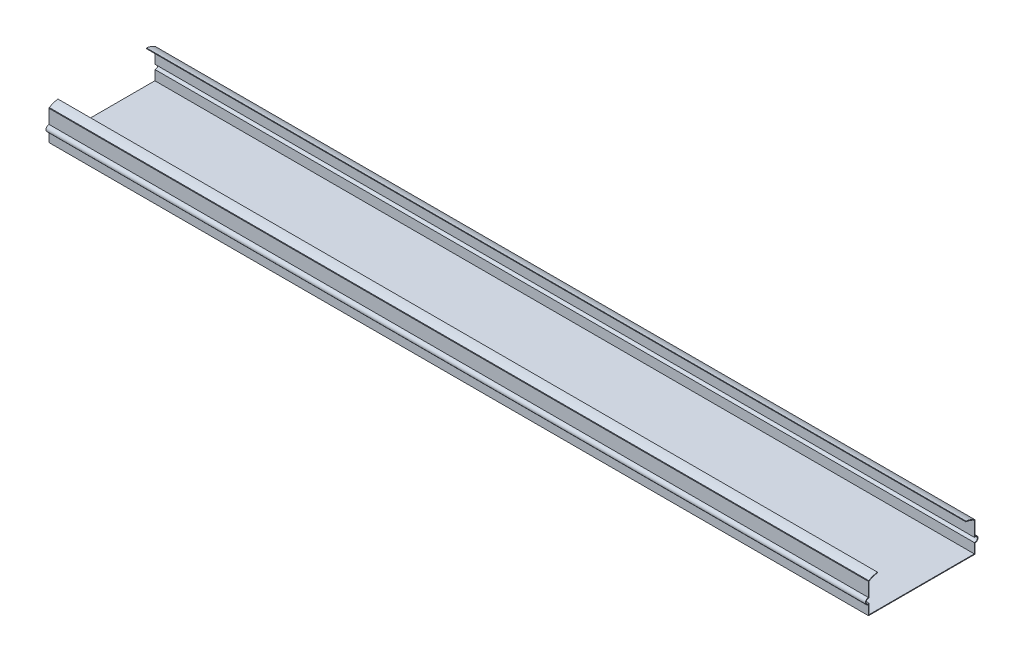
ISO-10303-21;
HEADER;
FILE_DESCRIPTION(('STEP AP214'),'2;1');
FILE_NAME('part.step','',(''),(''),'','','');
FILE_SCHEMA(('AUTOMOTIVE_DESIGN { 1 0 10303 214 1 1 1 1 }'));
ENDSEC;
DATA;
#1=APPLICATION_CONTEXT('core data for automotive mechanical design processes');
#2=APPLICATION_PROTOCOL_DEFINITION('international standard','automotive_design',2000,#1);
#3=PRODUCT_CONTEXT('',#1,'mechanical');
#4=PRODUCT('Part','Part','',(#3));
#5=PRODUCT_RELATED_PRODUCT_CATEGORY('part','',(#4));
#6=PRODUCT_DEFINITION_FORMATION('','',#4);
#7=PRODUCT_DEFINITION_CONTEXT('part definition',#1,'design');
#8=PRODUCT_DEFINITION('design','',#6,#7);
#9=PRODUCT_DEFINITION_SHAPE('','',#8);
#10=(LENGTH_UNIT() NAMED_UNIT(*) SI_UNIT(.MILLI.,.METRE.));
#11=(NAMED_UNIT(*) PLANE_ANGLE_UNIT() SI_UNIT($,.RADIAN.));
#12=(NAMED_UNIT(*) SI_UNIT($,.STERADIAN.) SOLID_ANGLE_UNIT());
#13=UNCERTAINTY_MEASURE_WITH_UNIT(LENGTH_MEASURE(1.E-05),#10,'distance_accuracy_value','');
#14=(GEOMETRIC_REPRESENTATION_CONTEXT(3) GLOBAL_UNCERTAINTY_ASSIGNED_CONTEXT((#13)) GLOBAL_UNIT_ASSIGNED_CONTEXT((#10,
#11,#12)) REPRESENTATION_CONTEXT('',''));
#15=CARTESIAN_POINT('',(0.,0.,0.));
#16=DIRECTION('',(0.,0.,1.));
#17=DIRECTION('',(1.,0.,0.));
#18=AXIS2_PLACEMENT_3D('',#15,#16,#17);
#19=CARTESIAN_POINT('',(0.,0.2,0.));
#20=DIRECTION('',(0.,1.,0.));
#21=DIRECTION('',(0.,0.,1.));
#22=AXIS2_PLACEMENT_3D('',#19,#20,#21);
#23=PLANE('',#22);
#24=DIRECTION('',(-1.,0.,0.));
#25=VECTOR('',#24,1.);
#26=CARTESIAN_POINT('',(120.981837705448,0.2,16.2968));
#27=LINE('',#26,#25);
#28=CARTESIAN_POINT('',(120.981837705448,0.2,16.2968));
#29=VERTEX_POINT('',#28);
#30=CARTESIAN_POINT('',(-133.018162294552,0.2,16.2968));
#31=VERTEX_POINT('',#30);
#32=EDGE_CURVE('E198',#29,#31,#27,.T.);
#33=ORIENTED_EDGE('',*,*,#32,.F.);
#34=DIRECTION('',(0.,0.,-1.));
#35=VECTOR('',#34,1.);
#36=CARTESIAN_POINT('',(120.981837705448,0.2,-16.5));
#37=LINE('',#36,#35);
#38=CARTESIAN_POINT('',(120.981837705448,0.2,-16.2968));
#39=VERTEX_POINT('',#38);
#40=EDGE_CURVE('E39',#29,#39,#37,.T.);
#41=ORIENTED_EDGE('',*,*,#40,.T.);
#42=DIRECTION('',(-1.,0.,0.));
#43=VECTOR('',#42,1.);
#44=CARTESIAN_POINT('',(120.981837705448,0.2,-16.2968));
#45=LINE('',#44,#43);
#46=CARTESIAN_POINT('',(-133.018162294552,0.2,-16.2968));
#47=VERTEX_POINT('',#46);
#48=EDGE_CURVE('E309',#39,#47,#45,.T.);
#49=ORIENTED_EDGE('',*,*,#48,.T.);
#50=DIRECTION('',(0.,0.,1.));
#51=VECTOR('',#50,1.);
#52=CARTESIAN_POINT('',(-133.018162294552,0.2,-16.5));
#53=LINE('',#52,#51);
#54=EDGE_CURVE('E53',#47,#31,#53,.T.);
#55=ORIENTED_EDGE('',*,*,#54,.T.);
#56=EDGE_LOOP('',(#33,#41,#49,#55));
#57=FACE_BOUND('',#56,.T.);
#58=ADVANCED_FACE('F35',(#57),#23,.T.);
#59=CARTESIAN_POINT('',(-133.018162294552,0.2,-16.5));
#60=DIRECTION('',(1.,0.,0.));
#61=DIRECTION('',(0.,0.,-1.));
#62=AXIS2_PLACEMENT_3D('',#59,#60,#61);
#63=PLANE('',#62);
#64=DIRECTION('',(0.,0.,1.));
#65=VECTOR('',#64,1.);
#66=CARTESIAN_POINT('',(-133.018162294552,0.,-16.5));
#67=LINE('',#66,#65);
#68=CARTESIAN_POINT('',(-133.018162294552,0.,-16.5));
#69=VERTEX_POINT('',#68);
#70=CARTESIAN_POINT('',(-133.018162294552,0.,16.5));
#71=VERTEX_POINT('',#70);
#72=EDGE_CURVE('E375',#69,#71,#67,.T.);
#73=ORIENTED_EDGE('',*,*,#72,.T.);
#74=DIRECTION('',(0.,-1.,0.));
#75=VECTOR('',#74,1.);
#76=CARTESIAN_POINT('',(-133.018162294552,0.2,16.5));
#77=LINE('',#76,#75);
#78=CARTESIAN_POINT('',(-133.018162294552,3.00561190530003,16.5));
#79=VERTEX_POINT('',#78);
#80=EDGE_CURVE('E11',#79,#71,#77,.T.);
#81=ORIENTED_EDGE('',*,*,#80,.F.);
#82=CARTESIAN_POINT('',(-133.018162294552,3.94490993934206,16.5));
#83=DIRECTION('',(-1.,0.,0.));
#84=DIRECTION('',(0.,0.,1.));
#85=AXIS2_PLACEMENT_3D('',#82,#83,#84);
#86=CIRCLE('',#85,0.939298034042025);
#87=CARTESIAN_POINT('',(-133.018162294552,4.88420797338408,16.5));
#88=VERTEX_POINT('',#87);
#89=EDGE_CURVE('E207',#79,#88,#86,.T.);
#90=ORIENTED_EDGE('',*,*,#89,.T.);
#91=DIRECTION('',(0.,1.,0.));
#92=VECTOR('',#91,1.);
#93=CARTESIAN_POINT('',(-133.018162294552,4.88420797338408,16.5));
#94=LINE('',#93,#92);
#95=CARTESIAN_POINT('',(-133.018162294552,9.2,16.5));
#96=VERTEX_POINT('',#95);
#97=EDGE_CURVE('E212',#88,#96,#94,.T.);
#98=ORIENTED_EDGE('',*,*,#97,.T.);
#99=DIRECTION('',(0.,0.877446855655144,-0.479673863683338));
#100=VECTOR('',#99,1.);
#101=CARTESIAN_POINT('',(-133.018162294552,9.37104901464151,16.4064926369004));
#102=LINE('',#101,#100);
#103=CARTESIAN_POINT('',(-133.018162294552,9.37104901464151,16.4064926369004));
#104=VERTEX_POINT('',#103);
#105=EDGE_CURVE('E465',#96,#104,#102,.T.);
#106=ORIENTED_EDGE('',*,*,#105,.T.);
#107=CARTESIAN_POINT('',(-133.018162294552,9.37104901464151,16.4064926369004));
#108=CARTESIAN_POINT('',(-133.018162294552,9.88402019754242,15.6065919520957));
#109=CARTESIAN_POINT('',(-133.018162294552,10.2162484337515,14.6578422945512));
#110=CARTESIAN_POINT('',(-133.018162294552,10.2998143236496,13.7112709649181));
#111=B_SPLINE_CURVE_WITH_KNOTS('',3,(#107,#108,#109,#110),.UNSPECIFIED.,.F.,.F.,(4,4),(0.,1.),.UNSPECIFIED.);
#112=CARTESIAN_POINT('',(-133.018162294552,10.2998143236496,13.7112709649181));
#113=VERTEX_POINT('',#112);
#114=EDGE_CURVE('E460',#104,#113,#111,.T.);
#115=ORIENTED_EDGE('',*,*,#114,.T.);
#116=DIRECTION('',(0.,-0.99612571286247,-0.0879406855456291));
#117=VECTOR('',#116,1.);
#118=CARTESIAN_POINT('',(-133.018162294552,10.2998143236496,13.7112709649181));
#119=LINE('',#118,#117);
#120=CARTESIAN_POINT('',(-133.018162294552,10.097401578796,13.6934014176153));
#121=VERTEX_POINT('',#120);
#122=EDGE_CURVE('E454',#113,#121,#119,.T.);
#123=ORIENTED_EDGE('',*,*,#122,.T.);
#124=CARTESIAN_POINT('',(-133.018162294552,10.097401578796,13.6934014176153));
#125=CARTESIAN_POINT('',(-133.018162294552,9.97413686293848,15.0896510851327));
#126=CARTESIAN_POINT('',(-133.018162294552,9.2,16.2968));
#127=B_SPLINE_CURVE_WITH_KNOTS('',2,(#124,#125,#126),.UNSPECIFIED.,.F.,.F.,(3,3),(0.,1.),.UNSPECIFIED.);
#128=CARTESIAN_POINT('',(-133.018162294552,9.2,16.2968));
#129=VERTEX_POINT('',#128);
#130=EDGE_CURVE('E449',#121,#129,#127,.T.);
#131=ORIENTED_EDGE('',*,*,#130,.T.);
#132=DIRECTION('',(0.,-1.,0.));
#133=VECTOR('',#132,1.);
#134=CARTESIAN_POINT('',(-133.018162294552,4.65240557588022,16.2968));
#135=LINE('',#134,#133);
#136=CARTESIAN_POINT('',(-133.018162294552,4.65240557588022,16.2968));
#137=VERTEX_POINT('',#136);
#138=EDGE_CURVE('E443',#129,#137,#135,.T.);
#139=ORIENTED_EDGE('',*,*,#138,.T.);
#140=CARTESIAN_POINT('',(-133.018162294552,3.94490993934206,16.5));
#141=DIRECTION('',(1.,0.,0.));
#142=DIRECTION('',(0.,0.,1.));
#143=AXIS2_PLACEMENT_3D('',#140,#141,#142);
#144=CIRCLE('',#143,0.736098034042025);
#145=CARTESIAN_POINT('',(-133.018162294552,3.2374143028039,16.2968));
#146=VERTEX_POINT('',#145);
#147=EDGE_CURVE('E441',#137,#146,#144,.T.);
#148=ORIENTED_EDGE('',*,*,#147,.T.);
#149=DIRECTION('',(0.,-1.,0.));
#150=VECTOR('',#149,1.);
#151=CARTESIAN_POINT('',(-133.018162294552,0.2,16.2968));
#152=LINE('',#151,#150);
#153=EDGE_CURVE('E438',#146,#31,#152,.T.);
#154=ORIENTED_EDGE('',*,*,#153,.T.);
#155=ORIENTED_EDGE('',*,*,#54,.F.);
#156=DIRECTION('',(0.,-1.,0.));
#157=VECTOR('',#156,1.);
#158=CARTESIAN_POINT('',(-133.018162294552,0.2,-16.2968));
#159=LINE('',#158,#157);
#160=CARTESIAN_POINT('',(-133.018162294552,3.2374143028039,-16.2968));
#161=VERTEX_POINT('',#160);
#162=EDGE_CURVE('E61',#161,#47,#159,.T.);
#163=ORIENTED_EDGE('',*,*,#162,.F.);
#164=CARTESIAN_POINT('',(-133.018162294552,3.94490993934206,-16.5));
#165=DIRECTION('',(-1.,0.,0.));
#166=DIRECTION('',(0.,0.,-1.));
#167=AXIS2_PLACEMENT_3D('',#164,#165,#166);
#168=CIRCLE('',#167,0.736098034042025);
#169=CARTESIAN_POINT('',(-133.018162294552,4.65240557588022,-16.2968));
#170=VERTEX_POINT('',#169);
#171=EDGE_CURVE('E302',#170,#161,#168,.T.);
#172=ORIENTED_EDGE('',*,*,#171,.F.);
#173=DIRECTION('',(0.,-1.,0.));
#174=VECTOR('',#173,1.);
#175=CARTESIAN_POINT('',(-133.018162294552,4.65240557588022,-16.2968));
#176=LINE('',#175,#174);
#177=CARTESIAN_POINT('',(-133.018162294552,9.2,-16.2968));
#178=VERTEX_POINT('',#177);
#179=EDGE_CURVE('E297',#178,#170,#176,.T.);
#180=ORIENTED_EDGE('',*,*,#179,.F.);
#181=CARTESIAN_POINT('',(-133.018162294552,10.097401578796,-13.6934014176153));
#182=CARTESIAN_POINT('',(-133.018162294552,9.97413686293848,-15.0896510851327));
#183=CARTESIAN_POINT('',(-133.018162294552,9.2,-16.2968));
#184=B_SPLINE_CURVE_WITH_KNOTS('',2,(#181,#182,#183),.UNSPECIFIED.,.F.,.F.,(3,3),(0.,1.),.UNSPECIFIED.);
#185=CARTESIAN_POINT('',(-133.018162294552,10.097401578796,-13.6934014176153));
#186=VERTEX_POINT('',#185);
#187=EDGE_CURVE('E293',#186,#178,#184,.T.);
#188=ORIENTED_EDGE('',*,*,#187,.F.);
#189=DIRECTION('',(0.,-0.99612571286247,0.0879406855456291));
#190=VECTOR('',#189,1.);
#191=CARTESIAN_POINT('',(-133.018162294552,10.2998143236496,-13.7112709649181));
#192=LINE('',#191,#190);
#193=CARTESIAN_POINT('',(-133.018162294552,10.2998143236496,-13.7112709649181));
#194=VERTEX_POINT('',#193);
#195=EDGE_CURVE('E288',#194,#186,#192,.T.);
#196=ORIENTED_EDGE('',*,*,#195,.F.);
#197=CARTESIAN_POINT('',(-133.018162294552,9.37104901464151,-16.4064926369004));
#198=CARTESIAN_POINT('',(-133.018162294552,9.88402019754242,-15.6065919520957));
#199=CARTESIAN_POINT('',(-133.018162294552,10.2162484337515,-14.6578422945512));
#200=CARTESIAN_POINT('',(-133.018162294552,10.2998143236496,-13.7112709649181));
#201=B_SPLINE_CURVE_WITH_KNOTS('',3,(#197,#198,#199,#200),.UNSPECIFIED.,.F.,.F.,(4,4),(0.,1.),.UNSPECIFIED.);
#202=CARTESIAN_POINT('',(-133.018162294552,9.37104901464151,-16.4064926369004));
#203=VERTEX_POINT('',#202);
#204=EDGE_CURVE('E284',#203,#194,#201,.T.);
#205=ORIENTED_EDGE('',*,*,#204,.F.);
#206=DIRECTION('',(0.,0.877446855655144,0.479673863683338));
#207=VECTOR('',#206,1.);
#208=CARTESIAN_POINT('',(-133.018162294552,9.37104901464151,-16.4064926369004));
#209=LINE('',#208,#207);
#210=CARTESIAN_POINT('',(-133.018162294552,9.2,-16.5));
#211=VERTEX_POINT('',#210);
#212=EDGE_CURVE('E282',#211,#203,#209,.T.);
#213=ORIENTED_EDGE('',*,*,#212,.F.);
#214=DIRECTION('',(0.,1.,0.));
#215=VECTOR('',#214,1.);
#216=CARTESIAN_POINT('',(-133.018162294552,4.88420797338408,-16.5));
#217=LINE('',#216,#215);
#218=CARTESIAN_POINT('',(-133.018162294552,4.88420797338408,-16.5));
#219=VERTEX_POINT('',#218);
#220=EDGE_CURVE('E280',#219,#211,#217,.T.);
#221=ORIENTED_EDGE('',*,*,#220,.F.);
#222=CARTESIAN_POINT('',(-133.018162294552,3.94490993934206,-16.5));
#223=DIRECTION('',(1.,0.,0.));
#224=DIRECTION('',(0.,0.,-1.));
#225=AXIS2_PLACEMENT_3D('',#222,#223,#224);
#226=CIRCLE('',#225,0.939298034042025);
#227=CARTESIAN_POINT('',(-133.018162294552,3.00561190530003,-16.5));
#228=VERTEX_POINT('',#227);
#229=EDGE_CURVE('E202',#228,#219,#226,.T.);
#230=ORIENTED_EDGE('',*,*,#229,.F.);
#231=DIRECTION('',(0.,-1.,0.));
#232=VECTOR('',#231,1.);
#233=CARTESIAN_POINT('',(-133.018162294552,0.2,-16.5));
#234=LINE('',#233,#232);
#235=EDGE_CURVE('E197',#228,#69,#234,.T.);
#236=ORIENTED_EDGE('',*,*,#235,.T.);
#237=EDGE_LOOP('',(#73,#81,#90,#98,#106,#115,#123,#131,#139,#148,#154,#155,#163,#172,#180,#188,
#196,#205,#213,#221,#230,#236));
#238=FACE_BOUND('',#237,.T.);
#239=ADVANCED_FACE('F37',(#238),#63,.F.);
#240=CARTESIAN_POINT('',(-133.018162294552,0.2,16.5));
#241=DIRECTION('',(0.,0.,-1.));
#242=DIRECTION('',(-1.,0.,0.));
#243=AXIS2_PLACEMENT_3D('',#240,#241,#242);
#244=PLANE('',#243);
#245=DIRECTION('',(1.,0.,0.));
#246=VECTOR('',#245,1.);
#247=CARTESIAN_POINT('',(-133.018162294552,0.,16.5));
#248=LINE('',#247,#246);
#249=CARTESIAN_POINT('',(120.981837705448,0.,16.5));
#250=VERTEX_POINT('',#249);
#251=EDGE_CURVE('E367',#71,#250,#248,.T.);
#252=ORIENTED_EDGE('',*,*,#251,.T.);
#253=DIRECTION('',(0.,-1.,0.));
#254=VECTOR('',#253,1.);
#255=CARTESIAN_POINT('',(120.981837705448,0.2,16.5));
#256=LINE('',#255,#254);
#257=CARTESIAN_POINT('',(120.981837705448,3.00561190530003,16.5));
#258=VERTEX_POINT('',#257);
#259=EDGE_CURVE('E45',#258,#250,#256,.T.);
#260=ORIENTED_EDGE('',*,*,#259,.F.);
#261=DIRECTION('',(-1.,0.,0.));
#262=VECTOR('',#261,1.);
#263=CARTESIAN_POINT('',(120.981837705448,3.00561190530003,16.5));
#264=LINE('',#263,#262);
#265=EDGE_CURVE('E473',#258,#79,#264,.T.);
#266=ORIENTED_EDGE('',*,*,#265,.T.);
#267=ORIENTED_EDGE('',*,*,#80,.T.);
#268=EDGE_LOOP('',(#252,#260,#266,#267));
#269=FACE_BOUND('',#268,.T.);
#270=ADVANCED_FACE('F360',(#269),#244,.F.);
#271=CARTESIAN_POINT('',(120.981837705448,0.2,-16.5));
#272=DIRECTION('',(-1.,0.,0.));
#273=DIRECTION('',(0.,0.,1.));
#274=AXIS2_PLACEMENT_3D('',#271,#272,#273);
#275=PLANE('',#274);
#276=DIRECTION('',(0.,0.,-1.));
#277=VECTOR('',#276,1.);
#278=CARTESIAN_POINT('',(120.981837705448,0.,-16.5));
#279=LINE('',#278,#277);
#280=CARTESIAN_POINT('',(120.981837705448,0.,-16.5));
#281=VERTEX_POINT('',#280);
#282=EDGE_CURVE('E374',#250,#281,#279,.T.);
#283=ORIENTED_EDGE('',*,*,#282,.T.);
#284=DIRECTION('',(0.,-1.,0.));
#285=VECTOR('',#284,1.);
#286=CARTESIAN_POINT('',(120.981837705448,0.2,-16.5));
#287=LINE('',#286,#285);
#288=CARTESIAN_POINT('',(120.981837705448,3.00561190530003,-16.5));
#289=VERTEX_POINT('',#288);
#290=EDGE_CURVE('E382',#289,#281,#287,.T.);
#291=ORIENTED_EDGE('',*,*,#290,.F.);
#292=CARTESIAN_POINT('',(120.981837705448,3.94490993934206,-16.5));
#293=DIRECTION('',(1.,0.,0.));
#294=DIRECTION('',(0.,0.,-1.));
#295=AXIS2_PLACEMENT_3D('',#292,#293,#294);
#296=CIRCLE('',#295,0.939298034042025);
#297=CARTESIAN_POINT('',(120.981837705448,4.88420797338408,-16.5));
#298=VERTEX_POINT('',#297);
#299=EDGE_CURVE('E314',#289,#298,#296,.T.);
#300=ORIENTED_EDGE('',*,*,#299,.T.);
#301=DIRECTION('',(0.,1.,0.));
#302=VECTOR('',#301,1.);
#303=CARTESIAN_POINT('',(120.981837705448,4.88420797338408,-16.5));
#304=LINE('',#303,#302);
#305=CARTESIAN_POINT('',(120.981837705448,9.2,-16.5));
#306=VERTEX_POINT('',#305);
#307=EDGE_CURVE('E318',#298,#306,#304,.T.);
#308=ORIENTED_EDGE('',*,*,#307,.T.);
#309=DIRECTION('',(0.,0.877446855655144,0.479673863683338));
#310=VECTOR('',#309,1.);
#311=CARTESIAN_POINT('',(120.981837705448,9.37104901464151,-16.4064926369004));
#312=LINE('',#311,#310);
#313=CARTESIAN_POINT('',(120.981837705448,9.37104901464151,-16.4064926369004));
#314=VERTEX_POINT('',#313);
#315=EDGE_CURVE('E322',#306,#314,#312,.T.);
#316=ORIENTED_EDGE('',*,*,#315,.T.);
#317=CARTESIAN_POINT('',(120.981837705448,9.37104901464151,-16.4064926369004));
#318=CARTESIAN_POINT('',(120.981837705448,9.88402019754242,-15.6065919520957));
#319=CARTESIAN_POINT('',(120.981837705448,10.2162484337515,-14.6578422945512));
#320=CARTESIAN_POINT('',(120.981837705448,10.2998143236496,-13.7112709649181));
#321=B_SPLINE_CURVE_WITH_KNOTS('',3,(#317,#318,#319,#320),.UNSPECIFIED.,.F.,.F.,(4,4),(0.,1.),.UNSPECIFIED.);
#322=CARTESIAN_POINT('',(120.981837705448,10.2998143236496,-13.7112709649181));
#323=VERTEX_POINT('',#322);
#324=EDGE_CURVE('E326',#314,#323,#321,.T.);
#325=ORIENTED_EDGE('',*,*,#324,.T.);
#326=DIRECTION('',(0.,-0.99612571286247,0.0879406855456291));
#327=VECTOR('',#326,1.);
#328=CARTESIAN_POINT('',(120.981837705448,10.2998143236496,-13.7112709649181));
#329=LINE('',#328,#327);
#330=CARTESIAN_POINT('',(120.981837705448,10.097401578796,-13.6934014176153));
#331=VERTEX_POINT('',#330);
#332=EDGE_CURVE('E271',#323,#331,#329,.T.);
#333=ORIENTED_EDGE('',*,*,#332,.T.);
#334=CARTESIAN_POINT('',(120.981837705448,10.097401578796,-13.6934014176153));
#335=CARTESIAN_POINT('',(120.981837705448,9.97413686293848,-15.0896510851327));
#336=CARTESIAN_POINT('',(120.981837705448,9.2,-16.2968));
#337=B_SPLINE_CURVE_WITH_KNOTS('',2,(#334,#335,#336),.UNSPECIFIED.,.F.,.F.,(3,3),(0.,1.),.UNSPECIFIED.);
#338=CARTESIAN_POINT('',(120.981837705448,9.2,-16.2968));
#339=VERTEX_POINT('',#338);
#340=EDGE_CURVE('E264',#331,#339,#337,.T.);
#341=ORIENTED_EDGE('',*,*,#340,.T.);
#342=DIRECTION('',(0.,-1.,0.));
#343=VECTOR('',#342,1.);
#344=CARTESIAN_POINT('',(120.981837705448,4.65240557588022,-16.2968));
#345=LINE('',#344,#343);
#346=CARTESIAN_POINT('',(120.981837705448,4.65240557588022,-16.2968));
#347=VERTEX_POINT('',#346);
#348=EDGE_CURVE('E270',#339,#347,#345,.T.);
#349=ORIENTED_EDGE('',*,*,#348,.T.);
#350=CARTESIAN_POINT('',(120.981837705448,3.94490993934206,-16.5));
#351=DIRECTION('',(-1.,0.,0.));
#352=DIRECTION('',(0.,0.,-1.));
#353=AXIS2_PLACEMENT_3D('',#350,#351,#352);
#354=CIRCLE('',#353,0.736098034042025);
#355=CARTESIAN_POINT('',(120.981837705448,3.2374143028039,-16.2968));
#356=VERTEX_POINT('',#355);
#357=EDGE_CURVE('E277',#347,#356,#354,.T.);
#358=ORIENTED_EDGE('',*,*,#357,.T.);
#359=DIRECTION('',(0.,-1.,0.));
#360=VECTOR('',#359,1.);
#361=CARTESIAN_POINT('',(120.981837705448,0.2,-16.2968));
#362=LINE('',#361,#360);
#363=EDGE_CURVE('E196',#356,#39,#362,.T.);
#364=ORIENTED_EDGE('',*,*,#363,.T.);
#365=ORIENTED_EDGE('',*,*,#40,.F.);
#366=DIRECTION('',(0.,-1.,0.));
#367=VECTOR('',#366,1.);
#368=CARTESIAN_POINT('',(120.981837705448,0.2,16.2968));
#369=LINE('',#368,#367);
#370=CARTESIAN_POINT('',(120.981837705448,3.2374143028039,16.2968));
#371=VERTEX_POINT('',#370);
#372=EDGE_CURVE('E193',#371,#29,#369,.T.);
#373=ORIENTED_EDGE('',*,*,#372,.F.);
#374=CARTESIAN_POINT('',(120.981837705448,3.94490993934206,16.5));
#375=DIRECTION('',(1.,0.,0.));
#376=DIRECTION('',(0.,0.,1.));
#377=AXIS2_PLACEMENT_3D('',#374,#375,#376);
#378=CIRCLE('',#377,0.736098034042025);
#379=CARTESIAN_POINT('',(120.981837705448,4.65240557588022,16.2968));
#380=VERTEX_POINT('',#379);
#381=EDGE_CURVE('E206',#380,#371,#378,.T.);
#382=ORIENTED_EDGE('',*,*,#381,.F.);
#383=DIRECTION('',(0.,-1.,0.));
#384=VECTOR('',#383,1.);
#385=CARTESIAN_POINT('',(120.981837705448,4.65240557588022,16.2968));
#386=LINE('',#385,#384);
#387=CARTESIAN_POINT('',(120.981837705448,9.2,16.2968));
#388=VERTEX_POINT('',#387);
#389=EDGE_CURVE('E209',#388,#380,#386,.T.);
#390=ORIENTED_EDGE('',*,*,#389,.F.);
#391=CARTESIAN_POINT('',(120.981837705448,10.097401578796,13.6934014176153));
#392=CARTESIAN_POINT('',(120.981837705448,9.97413686293848,15.0896510851327));
#393=CARTESIAN_POINT('',(120.981837705448,9.2,16.2968));
#394=B_SPLINE_CURVE_WITH_KNOTS('',2,(#391,#392,#393),.UNSPECIFIED.,.F.,.F.,(3,3),(0.,1.),.UNSPECIFIED.);
#395=CARTESIAN_POINT('',(120.981837705448,10.097401578796,13.6934014176153));
#396=VERTEX_POINT('',#395);
#397=EDGE_CURVE('E217',#396,#388,#394,.T.);
#398=ORIENTED_EDGE('',*,*,#397,.F.);
#399=DIRECTION('',(0.,-0.99612571286247,-0.0879406855456291));
#400=VECTOR('',#399,1.);
#401=CARTESIAN_POINT('',(120.981837705448,10.2998143236496,13.7112709649181));
#402=LINE('',#401,#400);
#403=CARTESIAN_POINT('',(120.981837705448,10.2998143236496,13.7112709649181));
#404=VERTEX_POINT('',#403);
#405=EDGE_CURVE('E223',#404,#396,#402,.T.);
#406=ORIENTED_EDGE('',*,*,#405,.F.);
#407=CARTESIAN_POINT('',(120.981837705448,9.37104901464151,16.4064926369004));
#408=CARTESIAN_POINT('',(120.981837705448,9.88402019754242,15.6065919520957));
#409=CARTESIAN_POINT('',(120.981837705448,10.2162484337515,14.6578422945512));
#410=CARTESIAN_POINT('',(120.981837705448,10.2998143236496,13.7112709649181));
#411=B_SPLINE_CURVE_WITH_KNOTS('',3,(#407,#408,#409,#410),.UNSPECIFIED.,.F.,.F.,(4,4),(0.,1.),.UNSPECIFIED.);
#412=CARTESIAN_POINT('',(120.981837705448,9.37104901464151,16.4064926369004));
#413=VERTEX_POINT('',#412);
#414=EDGE_CURVE('E498',#413,#404,#411,.T.);
#415=ORIENTED_EDGE('',*,*,#414,.F.);
#416=DIRECTION('',(0.,0.877446855655144,-0.479673863683338));
#417=VECTOR('',#416,1.);
#418=CARTESIAN_POINT('',(120.981837705448,9.37104901464151,16.4064926369004));
#419=LINE('',#418,#417);
#420=CARTESIAN_POINT('',(120.981837705448,9.2,16.5));
#421=VERTEX_POINT('',#420);
#422=EDGE_CURVE('E499',#421,#413,#419,.T.);
#423=ORIENTED_EDGE('',*,*,#422,.F.);
#424=DIRECTION('',(0.,1.,0.));
#425=VECTOR('',#424,1.);
#426=CARTESIAN_POINT('',(120.981837705448,4.88420797338408,16.5));
#427=LINE('',#426,#425);
#428=CARTESIAN_POINT('',(120.981837705448,4.88420797338408,16.5));
#429=VERTEX_POINT('',#428);
#430=EDGE_CURVE('E502',#429,#421,#427,.T.);
#431=ORIENTED_EDGE('',*,*,#430,.F.);
#432=CARTESIAN_POINT('',(120.981837705448,3.94490993934206,16.5));
#433=DIRECTION('',(-1.,0.,0.));
#434=DIRECTION('',(0.,0.,1.));
#435=AXIS2_PLACEMENT_3D('',#432,#433,#434);
#436=CIRCLE('',#435,0.939298034042025);
#437=EDGE_CURVE('E381',#258,#429,#436,.T.);
#438=ORIENTED_EDGE('',*,*,#437,.F.);
#439=ORIENTED_EDGE('',*,*,#259,.T.);
#440=EDGE_LOOP('',(#283,#291,#300,#308,#316,#325,#333,#341,#349,#358,#364,#365,#373,#382,#390,
#398,#406,#415,#423,#431,#438,#439));
#441=FACE_BOUND('',#440,.T.);
#442=ADVANCED_FACE('F190',(#441),#275,.F.);
#443=CARTESIAN_POINT('',(-133.018162294552,0.2,-16.5));
#444=DIRECTION('',(0.,0.,1.));
#445=DIRECTION('',(1.,0.,0.));
#446=AXIS2_PLACEMENT_3D('',#443,#444,#445);
#447=PLANE('',#446);
#448=DIRECTION('',(-1.,0.,0.));
#449=VECTOR('',#448,1.);
#450=CARTESIAN_POINT('',(-133.018162294552,0.,-16.5));
#451=LINE('',#450,#449);
#452=EDGE_CURVE('E385',#281,#69,#451,.T.);
#453=ORIENTED_EDGE('',*,*,#452,.T.);
#454=ORIENTED_EDGE('',*,*,#235,.F.);
#455=DIRECTION('',(-1.,0.,0.));
#456=VECTOR('',#455,1.);
#457=CARTESIAN_POINT('',(120.981837705448,3.00561190530003,-16.5));
#458=LINE('',#457,#456);
#459=EDGE_CURVE('E394',#289,#228,#458,.T.);
#460=ORIENTED_EDGE('',*,*,#459,.F.);
#461=ORIENTED_EDGE('',*,*,#290,.T.);
#462=EDGE_LOOP('',(#453,#454,#460,#461));
#463=FACE_BOUND('',#462,.T.);
#464=ADVANCED_FACE('F354',(#463),#447,.F.);
#465=CARTESIAN_POINT('',(0.,0.,0.));
#466=DIRECTION('',(0.,1.,0.));
#467=DIRECTION('',(0.,0.,1.));
#468=AXIS2_PLACEMENT_3D('',#465,#466,#467);
#469=PLANE('',#468);
#470=ORIENTED_EDGE('',*,*,#72,.F.);
#471=ORIENTED_EDGE('',*,*,#452,.F.);
#472=ORIENTED_EDGE('',*,*,#282,.F.);
#473=ORIENTED_EDGE('',*,*,#251,.F.);
#474=EDGE_LOOP('',(#470,#471,#472,#473));
#475=FACE_BOUND('',#474,.T.);
#476=ADVANCED_FACE('F348',(#475),#469,.F.);
#477=CARTESIAN_POINT('',(120.981837705448,3.94490993934206,-16.5));
#478=DIRECTION('',(-1.,0.,0.));
#479=DIRECTION('',(0.,0.,1.));
#480=AXIS2_PLACEMENT_3D('',#477,#478,#479);
#481=CYLINDRICAL_SURFACE('',#480,0.939298034042025);
#482=ORIENTED_EDGE('',*,*,#229,.T.);
#483=DIRECTION('',(-1.,0.,0.));
#484=VECTOR('',#483,1.);
#485=CARTESIAN_POINT('',(120.981837705448,4.88420797338408,-16.5));
#486=LINE('',#485,#484);
#487=EDGE_CURVE('E396',#298,#219,#486,.T.);
#488=ORIENTED_EDGE('',*,*,#487,.F.);
#489=ORIENTED_EDGE('',*,*,#299,.F.);
#490=ORIENTED_EDGE('',*,*,#459,.T.);
#491=EDGE_LOOP('',(#482,#488,#489,#490));
#492=FACE_BOUND('',#491,.T.);
#493=ADVANCED_FACE('F344',(#492),#481,.T.);
#494=CARTESIAN_POINT('',(120.981837705448,4.88420797338408,-16.5));
#495=DIRECTION('',(0.,0.,1.));
#496=DIRECTION('',(1.,0.,0.));
#497=AXIS2_PLACEMENT_3D('',#494,#495,#496);
#498=PLANE('',#497);
#499=ORIENTED_EDGE('',*,*,#220,.T.);
#500=DIRECTION('',(-1.,0.,0.));
#501=VECTOR('',#500,1.);
#502=CARTESIAN_POINT('',(120.981837705448,9.2,-16.5));
#503=LINE('',#502,#501);
#504=EDGE_CURVE('E401',#306,#211,#503,.T.);
#505=ORIENTED_EDGE('',*,*,#504,.F.);
#506=ORIENTED_EDGE('',*,*,#307,.F.);
#507=ORIENTED_EDGE('',*,*,#487,.T.);
#508=EDGE_LOOP('',(#499,#505,#506,#507));
#509=FACE_BOUND('',#508,.T.);
#510=ADVANCED_FACE('F340',(#509),#498,.F.);
#511=CARTESIAN_POINT('',(120.981837705448,9.37104901464151,-16.4064926369004));
#512=DIRECTION('',(0.,-0.479673863683338,0.877446855655144));
#513=DIRECTION('',(0.,-0.877446855655144,-0.479673863683338));
#514=AXIS2_PLACEMENT_3D('',#511,#512,#513);
#515=PLANE('',#514);
#516=ORIENTED_EDGE('',*,*,#212,.T.);
#517=DIRECTION('',(-1.,0.,0.));
#518=VECTOR('',#517,1.);
#519=CARTESIAN_POINT('',(120.981837705448,9.37104901464151,-16.4064926369004));
#520=LINE('',#519,#518);
#521=EDGE_CURVE('E410',#314,#203,#520,.T.);
#522=ORIENTED_EDGE('',*,*,#521,.F.);
#523=ORIENTED_EDGE('',*,*,#315,.F.);
#524=ORIENTED_EDGE('',*,*,#504,.T.);
#525=EDGE_LOOP('',(#516,#522,#523,#524));
#526=FACE_BOUND('',#525,.T.);
#527=ADVANCED_FACE('F336',(#526),#515,.F.);
#528=DIRECTION('',(-1.,0.,0.));
#529=VECTOR('',#528,1.);
#530=SURFACE_OF_LINEAR_EXTRUSION('',#321,#529);
#531=ORIENTED_EDGE('',*,*,#204,.T.);
#532=DIRECTION('',(-1.,0.,0.));
#533=VECTOR('',#532,1.);
#534=CARTESIAN_POINT('',(120.981837705448,10.2998143236496,-13.7112709649181));
#535=LINE('',#534,#533);
#536=EDGE_CURVE('E413',#323,#194,#535,.T.);
#537=ORIENTED_EDGE('',*,*,#536,.F.);
#538=ORIENTED_EDGE('',*,*,#324,.F.);
#539=ORIENTED_EDGE('',*,*,#521,.T.);
#540=EDGE_LOOP('',(#531,#537,#538,#539));
#541=FACE_BOUND('',#540,.T.);
#542=ADVANCED_FACE('F333',(#541),#530,.F.);
#543=CARTESIAN_POINT('',(120.981837705448,10.2998143236496,-13.7112709649181));
#544=DIRECTION('',(0.,-0.0879406855456291,-0.99612571286247));
#545=DIRECTION('',(0.,0.99612571286247,-0.0879406855456291));
#546=AXIS2_PLACEMENT_3D('',#543,#544,#545);
#547=PLANE('',#546);
#548=ORIENTED_EDGE('',*,*,#195,.T.);
#549=DIRECTION('',(-1.,0.,0.));
#550=VECTOR('',#549,1.);
#551=CARTESIAN_POINT('',(120.981837705448,10.097401578796,-13.6934014176153));
#552=LINE('',#551,#550);
#553=EDGE_CURVE('E419',#331,#186,#552,.T.);
#554=ORIENTED_EDGE('',*,*,#553,.F.);
#555=ORIENTED_EDGE('',*,*,#332,.F.);
#556=ORIENTED_EDGE('',*,*,#536,.T.);
#557=EDGE_LOOP('',(#548,#554,#555,#556));
#558=FACE_BOUND('',#557,.T.);
#559=ADVANCED_FACE('F261',(#558),#547,.F.);
#560=DIRECTION('',(-1.,0.,0.));
#561=VECTOR('',#560,1.);
#562=SURFACE_OF_LINEAR_EXTRUSION('',#337,#561);
#563=ORIENTED_EDGE('',*,*,#187,.T.);
#564=DIRECTION('',(-1.,0.,0.));
#565=VECTOR('',#564,1.);
#566=CARTESIAN_POINT('',(120.981837705448,9.2,-16.2968));
#567=LINE('',#566,#565);
#568=EDGE_CURVE('E428',#339,#178,#567,.T.);
#569=ORIENTED_EDGE('',*,*,#568,.F.);
#570=ORIENTED_EDGE('',*,*,#340,.F.);
#571=ORIENTED_EDGE('',*,*,#553,.T.);
#572=EDGE_LOOP('',(#563,#569,#570,#571));
#573=FACE_BOUND('',#572,.T.);
#574=ADVANCED_FACE('F256',(#573),#562,.F.);
#575=CARTESIAN_POINT('',(120.981837705448,4.65240557588022,-16.2968));
#576=DIRECTION('',(0.,0.,-1.));
#577=DIRECTION('',(-1.,0.,0.));
#578=AXIS2_PLACEMENT_3D('',#575,#576,#577);
#579=PLANE('',#578);
#580=ORIENTED_EDGE('',*,*,#179,.T.);
#581=DIRECTION('',(-1.,0.,0.));
#582=VECTOR('',#581,1.);
#583=CARTESIAN_POINT('',(120.981837705448,4.65240557588022,-16.2968));
#584=LINE('',#583,#582);
#585=EDGE_CURVE('E431',#347,#170,#584,.T.);
#586=ORIENTED_EDGE('',*,*,#585,.F.);
#587=ORIENTED_EDGE('',*,*,#348,.F.);
#588=ORIENTED_EDGE('',*,*,#568,.T.);
#589=EDGE_LOOP('',(#580,#586,#587,#588));
#590=FACE_BOUND('',#589,.T.);
#591=ADVANCED_FACE('F252',(#590),#579,.F.);
#592=CARTESIAN_POINT('',(120.981837705448,3.94490993934206,-16.5));
#593=DIRECTION('',(-1.,0.,0.));
#594=DIRECTION('',(0.,0.,1.));
#595=AXIS2_PLACEMENT_3D('',#592,#593,#594);
#596=CYLINDRICAL_SURFACE('',#595,0.736098034042025);
#597=ORIENTED_EDGE('',*,*,#171,.T.);
#598=DIRECTION('',(-1.,0.,0.));
#599=VECTOR('',#598,1.);
#600=CARTESIAN_POINT('',(120.981837705448,3.2374143028039,-16.2968));
#601=LINE('',#600,#599);
#602=EDGE_CURVE('E306',#356,#161,#601,.T.);
#603=ORIENTED_EDGE('',*,*,#602,.F.);
#604=ORIENTED_EDGE('',*,*,#357,.F.);
#605=ORIENTED_EDGE('',*,*,#585,.T.);
#606=EDGE_LOOP('',(#597,#603,#604,#605));
#607=FACE_BOUND('',#606,.T.);
#608=ADVANCED_FACE('F249',(#607),#596,.F.);
#609=CARTESIAN_POINT('',(120.981837705448,0.2,-16.2968));
#610=DIRECTION('',(0.,0.,-1.));
#611=DIRECTION('',(-1.,0.,0.));
#612=AXIS2_PLACEMENT_3D('',#609,#610,#611);
#613=PLANE('',#612);
#614=ORIENTED_EDGE('',*,*,#162,.T.);
#615=ORIENTED_EDGE('',*,*,#48,.F.);
#616=ORIENTED_EDGE('',*,*,#363,.F.);
#617=ORIENTED_EDGE('',*,*,#602,.T.);
#618=EDGE_LOOP('',(#614,#615,#616,#617));
#619=FACE_BOUND('',#618,.T.);
#620=ADVANCED_FACE('F246',(#619),#613,.F.);
#621=CARTESIAN_POINT('',(120.981837705448,0.2,16.2968));
#622=DIRECTION('',(0.,0.,-1.));
#623=DIRECTION('',(-1.,0.,0.));
#624=AXIS2_PLACEMENT_3D('',#621,#622,#623);
#625=PLANE('',#624);
#626=ORIENTED_EDGE('',*,*,#153,.F.);
#627=DIRECTION('',(-1.,0.,0.));
#628=VECTOR('',#627,1.);
#629=CARTESIAN_POINT('',(120.981837705448,3.2374143028039,16.2968));
#630=LINE('',#629,#628);
#631=EDGE_CURVE('E203',#371,#146,#630,.T.);
#632=ORIENTED_EDGE('',*,*,#631,.F.);
#633=ORIENTED_EDGE('',*,*,#372,.T.);
#634=ORIENTED_EDGE('',*,*,#32,.T.);
#635=EDGE_LOOP('',(#626,#632,#633,#634));
#636=FACE_BOUND('',#635,.T.);
#637=ADVANCED_FACE('F205',(#636),#625,.T.);
#638=CARTESIAN_POINT('',(120.981837705448,3.94490993934206,16.5));
#639=DIRECTION('',(-1.,0.,0.));
#640=DIRECTION('',(0.,0.,1.));
#641=AXIS2_PLACEMENT_3D('',#638,#639,#640);
#642=CYLINDRICAL_SURFACE('',#641,0.736098034042025);
#643=ORIENTED_EDGE('',*,*,#147,.F.);
#644=DIRECTION('',(-1.,0.,0.));
#645=VECTOR('',#644,1.);
#646=CARTESIAN_POINT('',(120.981837705448,4.65240557588022,16.2968));
#647=LINE('',#646,#645);
#648=EDGE_CURVE('E487',#380,#137,#647,.T.);
#649=ORIENTED_EDGE('',*,*,#648,.F.);
#650=ORIENTED_EDGE('',*,*,#381,.T.);
#651=ORIENTED_EDGE('',*,*,#631,.T.);
#652=EDGE_LOOP('',(#643,#649,#650,#651));
#653=FACE_BOUND('',#652,.T.);
#654=ADVANCED_FACE('F239',(#653),#642,.F.);
#655=CARTESIAN_POINT('',(120.981837705448,4.65240557588022,16.2968));
#656=DIRECTION('',(0.,0.,-1.));
#657=DIRECTION('',(-1.,0.,0.));
#658=AXIS2_PLACEMENT_3D('',#655,#656,#657);
#659=PLANE('',#658);
#660=ORIENTED_EDGE('',*,*,#138,.F.);
#661=DIRECTION('',(-1.,0.,0.));
#662=VECTOR('',#661,1.);
#663=CARTESIAN_POINT('',(120.981837705448,9.2,16.2968));
#664=LINE('',#663,#662);
#665=EDGE_CURVE('E485',#388,#129,#664,.T.);
#666=ORIENTED_EDGE('',*,*,#665,.F.);
#667=ORIENTED_EDGE('',*,*,#389,.T.);
#668=ORIENTED_EDGE('',*,*,#648,.T.);
#669=EDGE_LOOP('',(#660,#666,#667,#668));
#670=FACE_BOUND('',#669,.T.);
#671=ADVANCED_FACE('F234',(#670),#659,.T.);
#672=DIRECTION('',(-1.,0.,0.));
#673=VECTOR('',#672,1.);
#674=SURFACE_OF_LINEAR_EXTRUSION('',#394,#673);
#675=ORIENTED_EDGE('',*,*,#130,.F.);
#676=DIRECTION('',(-1.,0.,0.));
#677=VECTOR('',#676,1.);
#678=CARTESIAN_POINT('',(120.981837705448,10.097401578796,13.6934014176153));
#679=LINE('',#678,#677);
#680=EDGE_CURVE('E483',#396,#121,#679,.T.);
#681=ORIENTED_EDGE('',*,*,#680,.F.);
#682=ORIENTED_EDGE('',*,*,#397,.T.);
#683=ORIENTED_EDGE('',*,*,#665,.T.);
#684=EDGE_LOOP('',(#675,#681,#682,#683));
#685=FACE_BOUND('',#684,.T.);
#686=ADVANCED_FACE('F229',(#685),#674,.T.);
#687=CARTESIAN_POINT('',(120.981837705448,10.2998143236496,13.7112709649181));
#688=DIRECTION('',(0.,0.0879406855456291,-0.99612571286247));
#689=DIRECTION('',(0.,0.99612571286247,0.0879406855456291));
#690=AXIS2_PLACEMENT_3D('',#687,#688,#689);
#691=PLANE('',#690);
#692=ORIENTED_EDGE('',*,*,#122,.F.);
#693=DIRECTION('',(-1.,0.,0.));
#694=VECTOR('',#693,1.);
#695=CARTESIAN_POINT('',(120.981837705448,10.2998143236496,13.7112709649181));
#696=LINE('',#695,#694);
#697=EDGE_CURVE('E481',#404,#113,#696,.T.);
#698=ORIENTED_EDGE('',*,*,#697,.F.);
#699=ORIENTED_EDGE('',*,*,#405,.T.);
#700=ORIENTED_EDGE('',*,*,#680,.T.);
#701=EDGE_LOOP('',(#692,#698,#699,#700));
#702=FACE_BOUND('',#701,.T.);
#703=ADVANCED_FACE('F233',(#702),#691,.T.);
#704=DIRECTION('',(-1.,0.,0.));
#705=VECTOR('',#704,1.);
#706=SURFACE_OF_LINEAR_EXTRUSION('',#411,#705);
#707=ORIENTED_EDGE('',*,*,#114,.F.);
#708=DIRECTION('',(-1.,0.,0.));
#709=VECTOR('',#708,1.);
#710=CARTESIAN_POINT('',(120.981837705448,9.37104901464151,16.4064926369004));
#711=LINE('',#710,#709);
#712=EDGE_CURVE('E479',#413,#104,#711,.T.);
#713=ORIENTED_EDGE('',*,*,#712,.F.);
#714=ORIENTED_EDGE('',*,*,#414,.T.);
#715=ORIENTED_EDGE('',*,*,#697,.T.);
#716=EDGE_LOOP('',(#707,#713,#714,#715));
#717=FACE_BOUND('',#716,.T.);
#718=ADVANCED_FACE('F510',(#717),#706,.T.);
#719=CARTESIAN_POINT('',(120.981837705448,9.37104901464151,16.4064926369004));
#720=DIRECTION('',(0.,0.479673863683338,0.877446855655144));
#721=DIRECTION('',(0.,-0.877446855655144,0.479673863683338));
#722=AXIS2_PLACEMENT_3D('',#719,#720,#721);
#723=PLANE('',#722);
#724=ORIENTED_EDGE('',*,*,#105,.F.);
#725=DIRECTION('',(-1.,0.,0.));
#726=VECTOR('',#725,1.);
#727=CARTESIAN_POINT('',(120.981837705448,9.2,16.5));
#728=LINE('',#727,#726);
#729=EDGE_CURVE('E477',#421,#96,#728,.T.);
#730=ORIENTED_EDGE('',*,*,#729,.F.);
#731=ORIENTED_EDGE('',*,*,#422,.T.);
#732=ORIENTED_EDGE('',*,*,#712,.T.);
#733=EDGE_LOOP('',(#724,#730,#731,#732));
#734=FACE_BOUND('',#733,.T.);
#735=ADVANCED_FACE('F513',(#734),#723,.T.);
#736=CARTESIAN_POINT('',(120.981837705448,4.88420797338408,16.5));
#737=DIRECTION('',(0.,0.,1.));
#738=DIRECTION('',(1.,0.,0.));
#739=AXIS2_PLACEMENT_3D('',#736,#737,#738);
#740=PLANE('',#739);
#741=ORIENTED_EDGE('',*,*,#97,.F.);
#742=DIRECTION('',(-1.,0.,0.));
#743=VECTOR('',#742,1.);
#744=CARTESIAN_POINT('',(120.981837705448,4.88420797338408,16.5));
#745=LINE('',#744,#743);
#746=EDGE_CURVE('E475',#429,#88,#745,.T.);
#747=ORIENTED_EDGE('',*,*,#746,.F.);
#748=ORIENTED_EDGE('',*,*,#430,.T.);
#749=ORIENTED_EDGE('',*,*,#729,.T.);
#750=EDGE_LOOP('',(#741,#747,#748,#749));
#751=FACE_BOUND('',#750,.T.);
#752=ADVANCED_FACE('F516',(#751),#740,.T.);
#753=CARTESIAN_POINT('',(120.981837705448,3.94490993934206,16.5));
#754=DIRECTION('',(-1.,0.,0.));
#755=DIRECTION('',(0.,0.,1.));
#756=AXIS2_PLACEMENT_3D('',#753,#754,#755);
#757=CYLINDRICAL_SURFACE('',#756,0.939298034042025);
#758=ORIENTED_EDGE('',*,*,#89,.F.);
#759=ORIENTED_EDGE('',*,*,#265,.F.);
#760=ORIENTED_EDGE('',*,*,#437,.T.);
#761=ORIENTED_EDGE('',*,*,#746,.T.);
#762=EDGE_LOOP('',(#758,#759,#760,#761));
#763=FACE_BOUND('',#762,.T.);
#764=ADVANCED_FACE('F520',(#763),#757,.T.);
#765=CLOSED_SHELL('',(#58,#239,#270,#442,#464,#476,#493,#510,#527,#542,#559,#574,#591,#608,#620,
#637,#654,#671,#686,#703,#718,#735,#752,#764));
#766=MANIFOLD_SOLID_BREP('B2',#765);
#767=ADVANCED_BREP_SHAPE_REPRESENTATION('',(#18,#766),#14);
#768=SHAPE_DEFINITION_REPRESENTATION(#9,#767);
ENDSEC;
END-ISO-10303-21;
